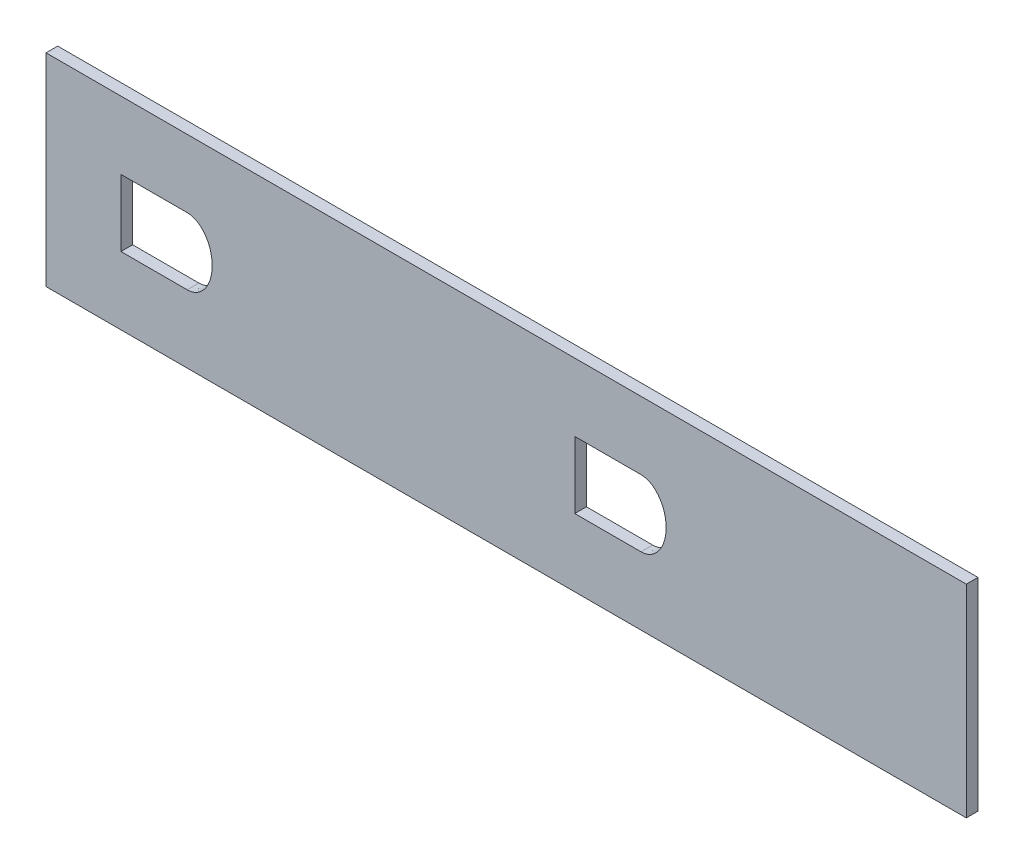
ISO-10303-21;
HEADER;
FILE_DESCRIPTION(('STEP AP214'),'2;1');
FILE_NAME('part.step','',(''),(''),'','','');
FILE_SCHEMA(('AUTOMOTIVE_DESIGN { 1 0 10303 214 1 1 1 1 }'));
ENDSEC;
DATA;
#1=APPLICATION_CONTEXT('core data for automotive mechanical design processes');
#2=APPLICATION_PROTOCOL_DEFINITION('international standard','automotive_design',2000,#1);
#3=PRODUCT_CONTEXT('',#1,'mechanical');
#4=PRODUCT('Part','Part','',(#3));
#5=PRODUCT_RELATED_PRODUCT_CATEGORY('part','',(#4));
#6=PRODUCT_DEFINITION_FORMATION('','',#4);
#7=PRODUCT_DEFINITION_CONTEXT('part definition',#1,'design');
#8=PRODUCT_DEFINITION('design','',#6,#7);
#9=PRODUCT_DEFINITION_SHAPE('','',#8);
#10=(LENGTH_UNIT() NAMED_UNIT(*) SI_UNIT(.MILLI.,.METRE.));
#11=(NAMED_UNIT(*) PLANE_ANGLE_UNIT() SI_UNIT($,.RADIAN.));
#12=(NAMED_UNIT(*) SI_UNIT($,.STERADIAN.) SOLID_ANGLE_UNIT());
#13=UNCERTAINTY_MEASURE_WITH_UNIT(LENGTH_MEASURE(1.E-05),#10,'distance_accuracy_value','');
#14=(GEOMETRIC_REPRESENTATION_CONTEXT(3) GLOBAL_UNCERTAINTY_ASSIGNED_CONTEXT((#13)) GLOBAL_UNIT_ASSIGNED_CONTEXT((#10,
#11,#12)) REPRESENTATION_CONTEXT('',''));
#15=CARTESIAN_POINT('',(0.,0.,0.));
#16=DIRECTION('',(0.,0.,1.));
#17=DIRECTION('',(1.,0.,0.));
#18=AXIS2_PLACEMENT_3D('',#15,#16,#17);
#19=CARTESIAN_POINT('',(0.,0.,3.175));
#20=DIRECTION('',(0.,0.,-1.));
#21=DIRECTION('',(-1.,0.,0.));
#22=AXIS2_PLACEMENT_3D('',#19,#20,#21);
#23=PLANE('',#22);
#24=CARTESIAN_POINT('',(154.922131775069,92.5118305241373,3.175));
#25=CARTESIAN_POINT('',(155.451072122834,92.50958186259,3.175));
#26=CARTESIAN_POINT('',(155.966488743538,92.5872283059475,3.175));
#27=CARTESIAN_POINT('',(156.720262524495,92.8180201663427,3.175));
#28=CARTESIAN_POINT('',(156.967329601161,92.9142100461991,3.175));
#29=CARTESIAN_POINT('',(157.440562635818,93.1370676149043,3.175));
#30=CARTESIAN_POINT('',(157.66870997454,93.2642896837003,3.175));
#31=CARTESIAN_POINT('',(158.109361081418,93.547905878124,3.175));
#32=CARTESIAN_POINT('',(158.322848526987,93.7052953379579,3.175));
#33=CARTESIAN_POINT('',(158.725811926167,94.0398776946519,3.175));
#34=CARTESIAN_POINT('',(158.916365170045,94.2175735112476,3.175));
#35=CARTESIAN_POINT('',(159.277979375497,94.5915231320785,3.175));
#36=CARTESIAN_POINT('',(159.449028618166,94.7877880935133,3.175));
#37=CARTESIAN_POINT('',(159.773040585186,95.197537620439,3.175));
#38=CARTESIAN_POINT('',(159.926674600091,95.4121290585207,3.175));
#39=CARTESIAN_POINT('',(160.355672211454,96.0712690522382,3.175));
#40=CARTESIAN_POINT('',(160.599679107189,96.5301270838029,3.175));
#41=CARTESIAN_POINT('',(161.016221353168,97.4809162590623,3.175));
#42=CARTESIAN_POINT('',(161.188951810193,97.9742694025772,3.175));
#43=CARTESIAN_POINT('',(161.602577215803,99.4931220115654,3.175));
#44=CARTESIAN_POINT('',(161.73359264352,100.524931205306,3.175));
#45=CARTESIAN_POINT('',(161.735557124766,102.623122345367,3.175));
#46=CARTESIAN_POINT('',(161.605853875756,103.653679040349,3.175));
#47=CARTESIAN_POINT('',(161.200790672101,105.159416326973,3.175));
#48=CARTESIAN_POINT('',(161.028182443224,105.658994330539,3.175));
#49=CARTESIAN_POINT('',(160.612184007481,106.616383576777,3.175));
#50=CARTESIAN_POINT('',(160.369184420594,107.075786107166,3.175));
#51=CARTESIAN_POINT('',(159.803943698579,107.950913477118,3.175));
#52=CARTESIAN_POINT('',(159.477972125658,108.370019433913,3.175));
#53=CARTESIAN_POINT('',(158.755362197718,109.122883671395,3.175));
#54=CARTESIAN_POINT('',(158.35777701687,109.460222149506,3.175));
#55=CARTESIAN_POINT('',(157.472283398277,110.036389619616,3.175));
#56=CARTESIAN_POINT('',(157.002434247253,110.263188922867,3.175));
#57=CARTESIAN_POINT('',(156.251245807354,110.498433871764,3.175));
#58=CARTESIAN_POINT('',(155.992182160484,110.558924387464,3.175));
#59=CARTESIAN_POINT('',(155.47582364748,110.638710893681,3.175));
#60=CARTESIAN_POINT('',(155.216383747324,110.658836285765,3.175));
#61=CARTESIAN_POINT('',(154.695009918083,110.659978780235,3.175));
#62=CARTESIAN_POINT('',(154.431095247901,110.640701574291,3.175));
#63=CARTESIAN_POINT('',(153.910289290079,110.562114075801,3.175));
#64=CARTESIAN_POINT('',(153.655525940508,110.503481148267,3.175));
#65=CARTESIAN_POINT('',(152.9071232249,110.273102195265,3.175));
#66=CARTESIAN_POINT('',(152.425108618962,110.043206699969,3.175));
#67=CARTESIAN_POINT('',(151.765189327718,109.618881991929,3.175));
#68=CARTESIAN_POINT('',(151.554283650929,109.463896805024,3.175));
#69=CARTESIAN_POINT('',(151.149237669747,109.128884712107,3.175));
#70=CARTESIAN_POINT('',(150.955383152028,108.948824722019,3.175));
#71=CARTESIAN_POINT('',(150.409337016022,108.386227365254,3.175));
#72=CARTESIAN_POINT('',(150.087348777121,107.977727043503,3.175));
#73=CARTESIAN_POINT('',(149.657727519858,107.322539743442,3.175));
#74=CARTESIAN_POINT('',(149.523002902212,107.095990511624,3.175));
#75=CARTESIAN_POINT('',(149.273641031869,106.634191326719,3.175));
#76=CARTESIAN_POINT('',(149.159230404404,106.399606928325,3.175));
#77=CARTESIAN_POINT('',(148.844302450094,105.685698781086,3.175));
#78=CARTESIAN_POINT('',(148.671877117622,105.196296118275,3.175));
#79=CARTESIAN_POINT('',(148.395778993735,104.192823589,3.175));
#80=CARTESIAN_POINT('',(148.291945980141,103.675154874473,3.175));
#81=CARTESIAN_POINT('',(148.155434551003,102.639811275944,3.175));
#82=CARTESIAN_POINT('',(148.121907539099,102.120882193076,3.175));
#83=CARTESIAN_POINT('',(148.120620469946,101.080643065558,3.175));
#84=CARTESIAN_POINT('',(148.153178729199,100.55679449383,3.175));
#85=CARTESIAN_POINT('',(148.28798979255,99.5180305681715,3.175));
#86=CARTESIAN_POINT('',(148.389132933896,99.0087462753487,3.175));
#87=CARTESIAN_POINT('',(148.660372295199,98.0108153531445,3.175));
#88=CARTESIAN_POINT('',(148.830374423647,97.5221405621647,3.175));
#89=CARTESIAN_POINT('',(149.247047531098,96.5677379749753,3.175));
#90=CARTESIAN_POINT('',(149.496015441349,96.0994340722305,3.175));
#91=CARTESIAN_POINT('',(150.064325141074,95.2246507105133,3.175));
#92=CARTESIAN_POINT('',(150.384695811896,94.8139947344025,3.175));
#93=CARTESIAN_POINT('',(150.930587216426,94.2462435003589,3.175));
#94=CARTESIAN_POINT('',(151.123829439118,94.0651597608847,3.175));
#95=CARTESIAN_POINT('',(151.525384514642,93.7295626045616,3.175));
#96=CARTESIAN_POINT('',(151.734697278583,93.5739125001113,3.175));
#97=CARTESIAN_POINT('',(152.390499243646,93.1466214874872,3.175));
#98=CARTESIAN_POINT('',(152.871681916921,92.9130003297597,3.175));
#99=CARTESIAN_POINT('',(153.61862310046,92.6772812203988,3.175));
#100=CARTESIAN_POINT('',(153.872798462709,92.616861833556,3.175));
#101=CARTESIAN_POINT('',(154.392171087141,92.5345387388178,3.175));
#102=CARTESIAN_POINT('',(154.657661601187,92.5129548549109,3.175));
#103=CARTESIAN_POINT('',(154.922131775069,92.5118305241373,3.175));
#104=B_SPLINE_CURVE_WITH_KNOTS('',3,(#24,#25,#26,#27,#28,#29,#30,#31,#32,#33,#34,#35,#36,#37,
#38,#39,#40,#41,#42,#43,#44,#45,#46,#47,#48,#49,#50,#51,#52,#53,#54,#55,#56,#57,#58,#59,#60,#61,
#62,#63,#64,#65,#66,#67,#68,#69,#70,#71,#72,#73,#74,#75,#76,#77,#78,#79,#80,#81,#82,#83,#84,#85,
#86,#87,#88,#89,#90,#91,#92,#93,#94,#95,#96,#97,#98,#99,#100,#101,#102,#103),.UNSPECIFIED.,.T.,
.F.,(4,2,2,2,2,2,2,2,2,2,2,2,2,2,2,2,2,2,2,2,2,2,2,2,2,2,2,2,2,2,2,2,2,2,2,2,2,2,2,4),(0.,
0.0312500000000002,0.0468750000000012,0.0625000000000022,0.0781250000000031,0.0937500000000041,
0.109375000000005,0.125000000000006,0.156250000000008,0.187500000000011,0.250000000000015,
0.312500000000019,0.34375000000002,0.375000000000021,0.406250000000022,0.437500000000023,
0.468750000000025,0.484375000000024,0.500000000000024,0.515625000000023,0.531250000000023,
0.562500000000022,0.578125000000022,0.593750000000021,0.625000000000022,0.640625000000022,
0.656250000000022,0.68750000000002,0.718750000000019,0.750000000000017,0.781250000000015,
0.812500000000013,0.843750000000012,0.87500000000001,0.906250000000008,0.921875000000007,
0.937500000000007,0.968750000000004,0.984375000000002,1.),.UNSPECIFIED.);
#105=CARTESIAN_POINT('',(154.944461655891,92.5117830471494,3.175));
#106=VERTEX_POINT('',#105);
#107=CARTESIAN_POINT('',(154.944441506955,110.65941986306,3.175));
#108=VERTEX_POINT('',#107);
#109=EDGE_CURVE('E184',#106,#108,#104,.T.);
#110=ORIENTED_EDGE('',*,*,#109,.F.);
#111=DIRECTION('',(1.,0.,0.));
#112=VECTOR('',#111,1.);
#113=CARTESIAN_POINT('',(136.944461655891,92.5117830471494,3.175));
#114=LINE('',#113,#112);
#115=CARTESIAN_POINT('',(136.944461655891,92.5117830471494,3.175));
#116=VERTEX_POINT('',#115);
#117=EDGE_CURVE('E199',#116,#106,#114,.T.);
#118=ORIENTED_EDGE('',*,*,#117,.F.);
#119=DIRECTION('',(0.,-1.,0.));
#120=VECTOR('',#119,1.);
#121=CARTESIAN_POINT('',(136.944461655891,110.659419863063,3.175));
#122=LINE('',#121,#120);
#123=CARTESIAN_POINT('',(136.944461655891,110.659419863063,3.175));
#124=VERTEX_POINT('',#123);
#125=EDGE_CURVE('E196',#124,#116,#122,.T.);
#126=ORIENTED_EDGE('',*,*,#125,.F.);
#127=DIRECTION('',(-1.,1.67304629183672E-13,0.));
#128=VECTOR('',#127,1.);
#129=CARTESIAN_POINT('',(154.944441506955,110.65941986306,3.175));
#130=LINE('',#129,#128);
#131=EDGE_CURVE('E189',#108,#124,#130,.T.);
#132=ORIENTED_EDGE('',*,*,#131,.F.);
#133=EDGE_LOOP('',(#110,#118,#126,#132));
#134=FACE_BOUND('',#133,.T.);
#135=DIRECTION('',(0.,1.,0.));
#136=VECTOR('',#135,1.);
#137=CARTESIAN_POINT('',(366.588298269734,74.0830697008945,3.175));
#138=LINE('',#137,#136);
#139=CARTESIAN_POINT('',(366.588298269734,74.0830697008945,3.175));
#140=VERTEX_POINT('',#139);
#141=CARTESIAN_POINT('',(366.588298269734,129.083069700894,3.175));
#142=VERTEX_POINT('',#141);
#143=EDGE_CURVE('E227',#140,#142,#138,.T.);
#144=ORIENTED_EDGE('',*,*,#143,.T.);
#145=DIRECTION('',(-1.,0.,0.));
#146=VECTOR('',#145,1.);
#147=CARTESIAN_POINT('',(116.588298269734,129.083069700894,3.175));
#148=LINE('',#147,#146);
#149=CARTESIAN_POINT('',(116.588298269734,129.083069700894,3.175));
#150=VERTEX_POINT('',#149);
#151=EDGE_CURVE('E230',#142,#150,#148,.T.);
#152=ORIENTED_EDGE('',*,*,#151,.T.);
#153=DIRECTION('',(0.,-1.,0.));
#154=VECTOR('',#153,1.);
#155=CARTESIAN_POINT('',(116.588298269734,74.0830697008944,3.175));
#156=LINE('',#155,#154);
#157=CARTESIAN_POINT('',(116.588298269734,74.0830697008944,3.175));
#158=VERTEX_POINT('',#157);
#159=EDGE_CURVE('E233',#150,#158,#156,.T.);
#160=ORIENTED_EDGE('',*,*,#159,.T.);
#161=DIRECTION('',(1.,0.,0.));
#162=VECTOR('',#161,1.);
#163=CARTESIAN_POINT('',(116.588298269734,74.0830697008944,3.175));
#164=LINE('',#163,#162);
#165=EDGE_CURVE('E235',#158,#140,#164,.T.);
#166=ORIENTED_EDGE('',*,*,#165,.T.);
#167=EDGE_LOOP('',(#144,#152,#160,#166));
#168=FACE_BOUND('',#167,.T.);
#169=DIRECTION('',(1.,0.,0.));
#170=VECTOR('',#169,1.);
#171=CARTESIAN_POINT('',(260.222355303343,92.511784215595,3.175));
#172=LINE('',#171,#170);
#173=CARTESIAN_POINT('',(260.222355303343,92.511784215595,3.175));
#174=VERTEX_POINT('',#173);
#175=CARTESIAN_POINT('',(278.222671977076,92.511784215592,3.175));
#176=VERTEX_POINT('',#175);
#177=EDGE_CURVE('E126',#174,#176,#172,.T.);
#178=ORIENTED_EDGE('',*,*,#177,.F.);
#179=DIRECTION('',(0.,-1.,0.));
#180=VECTOR('',#179,1.);
#181=CARTESIAN_POINT('',(260.222355303343,110.65941998397,3.175));
#182=LINE('',#181,#180);
#183=CARTESIAN_POINT('',(260.222355303343,110.65941998397,3.175));
#184=VERTEX_POINT('',#183);
#185=EDGE_CURVE('E148',#184,#174,#182,.T.);
#186=ORIENTED_EDGE('',*,*,#185,.F.);
#187=DIRECTION('',(-1.,0.,0.));
#188=VECTOR('',#187,1.);
#189=CARTESIAN_POINT('',(278.222355303343,110.65941998397,3.175));
#190=LINE('',#189,#188);
#191=CARTESIAN_POINT('',(278.222355303343,110.65941998397,3.175));
#192=VERTEX_POINT('',#191);
#193=EDGE_CURVE('E146',#192,#184,#190,.T.);
#194=ORIENTED_EDGE('',*,*,#193,.F.);
#195=CARTESIAN_POINT('',(278.244464764398,92.5118305241373,3.175));
#196=CARTESIAN_POINT('',(278.773421896324,92.5140792570382,3.175));
#197=CARTESIAN_POINT('',(279.288142611514,92.596096823464,3.175));
#198=CARTESIAN_POINT('',(280.040047698589,92.8321723254875,3.175));
#199=CARTESIAN_POINT('',(280.286553449094,92.9299719128162,3.175));
#200=CARTESIAN_POINT('',(280.758602429583,93.1555626458557,3.175));
#201=CARTESIAN_POINT('',(280.986126811532,93.2839180024771,3.175));
#202=CARTESIAN_POINT('',(281.425506636801,93.5693117067424,3.175));
#203=CARTESIAN_POINT('',(281.638411531725,93.7273826234056,3.175));
#204=CARTESIAN_POINT('',(282.040609192108,94.063197755952,3.175));
#205=CARTESIAN_POINT('',(282.230823379992,94.2413326460542,3.175));
#206=CARTESIAN_POINT('',(282.591831942944,94.6158494856255,3.175));
#207=CARTESIAN_POINT('',(282.76261460547,94.8122424403208,3.175));
#208=CARTESIAN_POINT('',(283.08615194898,95.2219676298465,3.175));
#209=CARTESIAN_POINT('',(283.239528042897,95.4363045123148,3.175));
#210=CARTESIAN_POINT('',(283.668884518686,96.0960804672866,3.175));
#211=CARTESIAN_POINT('',(283.913097500502,96.5550380529654,3.175));
#212=CARTESIAN_POINT('',(284.329853528498,97.5055386996938,3.175));
#213=CARTESIAN_POINT('',(284.502330929515,97.997517384757,3.175));
#214=CARTESIAN_POINT('',(284.91642511353,99.517971016755,3.175));
#215=CARTESIAN_POINT('',(285.046378019531,100.549745306848,3.175));
#216=CARTESIAN_POINT('',(285.044814781937,102.121799944166,3.175));
#217=CARTESIAN_POINT('',(285.010624566593,102.644051201392,3.175));
#218=CARTESIAN_POINT('',(284.875060839701,103.67187907438,3.175));
#219=CARTESIAN_POINT('',(284.77375636693,104.179515710883,3.175));
#220=CARTESIAN_POINT('',(284.568084190159,104.930912137642,3.175));
#221=CARTESIAN_POINT('',(284.490533244968,105.179693519094,3.175));
#222=CARTESIAN_POINT('',(284.316216827901,105.673658252171,3.175));
#223=CARTESIAN_POINT('',(284.219380858918,105.918716084619,3.175));
#224=CARTESIAN_POINT('',(283.903445519512,106.635729238192,3.175));
#225=CARTESIAN_POINT('',(283.657868711848,107.093856455726,3.175));
#226=CARTESIAN_POINT('',(283.088219022091,107.96546200023,3.175));
#227=CARTESIAN_POINT('',(282.760173435189,108.382711444906,3.175));
#228=CARTESIAN_POINT('',(282.033463395118,109.13247113604,3.175));
#229=CARTESIAN_POINT('',(281.634553417858,109.467765519068,3.175));
#230=CARTESIAN_POINT('',(280.748361649332,110.039964653802,3.175));
#231=CARTESIAN_POINT('',(280.276240556554,110.266288644905,3.175));
#232=CARTESIAN_POINT('',(279.5256055812,110.499795693153,3.175));
#233=CARTESIAN_POINT('',(279.266245360834,110.559993759381,3.175));
#234=CARTESIAN_POINT('',(278.74913197916,110.639237798879,3.175));
#235=CARTESIAN_POINT('',(278.489592578708,110.659075845263,3.175));
#236=CARTESIAN_POINT('',(277.968576738938,110.659755346663,3.175));
#237=CARTESIAN_POINT('',(277.705739424316,110.64036722656,3.175));
#238=CARTESIAN_POINT('',(277.184023608902,110.561035237292,3.175));
#239=CARTESIAN_POINT('',(276.929142893503,110.501933243247,3.175));
#240=CARTESIAN_POINT('',(276.18126552645,110.270113332047,3.175));
#241=CARTESIAN_POINT('',(275.700015579309,110.038969122054,3.175));
#242=CARTESIAN_POINT('',(275.041406475089,109.612107912205,3.175));
#243=CARTESIAN_POINT('',(274.831199129765,109.456312410273,3.175));
#244=CARTESIAN_POINT('',(274.427957501716,109.119854798806,3.175));
#245=CARTESIAN_POINT('',(274.234681563174,108.938684274543,3.175));
#246=CARTESIAN_POINT('',(273.69087265876,108.372863912495,3.175));
#247=CARTESIAN_POINT('',(273.371132047598,107.962581247229,3.175));
#248=CARTESIAN_POINT('',(272.803442127643,107.086545180786,3.175));
#249=CARTESIAN_POINT('',(272.555460171743,106.618328462242,3.175));
#250=CARTESIAN_POINT('',(272.140246084283,105.663673469707,3.175));
#251=CARTESIAN_POINT('',(271.970280108895,105.173422247842,3.175));
#252=CARTESIAN_POINT('',(271.698796298654,104.169418744634,3.175));
#253=CARTESIAN_POINT('',(271.597044089733,103.652000397504,3.175));
#254=CARTESIAN_POINT('',(271.463750137216,102.61520325544,3.175));
#255=CARTESIAN_POINT('',(271.431619183692,102.096013456944,3.175));
#256=CARTESIAN_POINT('',(271.432420625684,101.056142381365,3.175));
#257=CARTESIAN_POINT('',(271.465480168026,100.534518706538,3.175));
#258=CARTESIAN_POINT('',(271.60143378631,99.4935606239007,3.175));
#259=CARTESIAN_POINT('',(271.702953336501,98.9837109978605,3.175));
#260=CARTESIAN_POINT('',(271.974334699447,97.9856688395986,3.175));
#261=CARTESIAN_POINT('',(272.144107774676,97.497448187194,3.175));
#262=CARTESIAN_POINT('',(272.559447021439,96.5450250833622,3.175));
#263=CARTESIAN_POINT('',(272.807968522787,96.0766640973058,3.175));
#264=CARTESIAN_POINT('',(273.377301291151,95.2002096366313,3.175));
#265=CARTESIAN_POINT('',(273.698044062811,94.7896915472667,3.175));
#266=CARTESIAN_POINT('',(274.24387214837,94.2236191503369,3.175));
#267=CARTESIAN_POINT('',(274.437733921714,94.0426028701799,3.175));
#268=CARTESIAN_POINT('',(274.840910970945,93.7074615598039,3.175));
#269=CARTESIAN_POINT('',(275.050943128877,93.552404952883,3.175));
#270=CARTESIAN_POINT('',(275.489290372446,93.2693883017634,3.175));
#271=CARTESIAN_POINT('',(275.717594252101,93.1414116495259,3.175));
#272=CARTESIAN_POINT('',(276.19478358475,92.9159616595021,3.175));
#273=CARTESIAN_POINT('',(276.440761069653,92.8201125779056,3.175));
#274=CARTESIAN_POINT('',(276.940166093122,92.6664425289211,3.175));
#275=CARTESIAN_POINT('',(277.194749166095,92.6080570743242,3.175));
#276=CARTESIAN_POINT('',(277.714173451766,92.5300641368901,3.175));
#277=CARTESIAN_POINT('',(277.979986198434,92.5107061576868,3.175));
#278=CARTESIAN_POINT('',(278.244464764398,92.5118305241373,3.175));
#279=B_SPLINE_CURVE_WITH_KNOTS('',3,(#195,#196,#197,#198,#199,#200,#201,#202,#203,#204,#205,
#206,#207,#208,#209,#210,#211,#212,#213,#214,#215,#216,#217,#218,#219,#220,#221,#222,#223,#224,
#225,#226,#227,#228,#229,#230,#231,#232,#233,#234,#235,#236,#237,#238,#239,#240,#241,#242,#243,
#244,#245,#246,#247,#248,#249,#250,#251,#252,#253,#254,#255,#256,#257,#258,#259,#260,#261,#262,
#263,#264,#265,#266,#267,#268,#269,#270,#271,#272,#273,#274,#275,#276,#277,#278),.UNSPECIFIED.,
.T.,.F.,(4,2,2,2,2,2,2,2,2,2,2,2,2,2,2,2,2,2,2,2,2,2,2,2,2,2,2,2,2,2,2,2,2,2,2,2,2,2,2,2,2,4),
(0.,0.0312500000000012,0.0468750000000019,0.0625000000000025,0.0781250000000031,
0.0937500000000037,0.109375000000004,0.125000000000005,0.156250000000005,0.187500000000006,
0.250000000000006,0.281250000000007,0.312500000000008,0.328125000000007,0.343750000000007,
0.375000000000004,0.406250000000001,0.437499999999997,0.468749999999994,0.484374999999993,
0.499999999999991,0.515624999999989,0.531249999999988,0.562499999999984,0.578124999999984,
0.593749999999984,0.624999999999986,0.656249999999987,0.687499999999989,0.718749999999991,
0.749999999999992,0.781249999999994,0.812499999999996,0.843749999999998,0.874999999999999,
0.906250000000001,0.921875000000001,0.937500000000001,0.953125,0.96875,0.984375,1.),.UNSPECIFIED.);
#280=EDGE_CURVE('E134',#176,#192,#279,.T.);
#281=ORIENTED_EDGE('',*,*,#280,.F.);
#282=EDGE_LOOP('',(#178,#186,#194,#281));
#283=FACE_BOUND('',#282,.T.);
#284=ADVANCED_FACE('F37',(#134,#168,#283),#23,.F.);
#285=CARTESIAN_POINT('',(0.,0.,0.));
#286=DIRECTION('',(0.,0.,-1.));
#287=DIRECTION('',(-1.,0.,0.));
#288=AXIS2_PLACEMENT_3D('',#285,#286,#287);
#289=PLANE('',#288);
#290=DIRECTION('',(0.,1.,0.));
#291=VECTOR('',#290,1.);
#292=CARTESIAN_POINT('',(366.588298269734,74.0830697008945,0.));
#293=LINE('',#292,#291);
#294=CARTESIAN_POINT('',(366.588298269734,74.0830697008945,0.));
#295=VERTEX_POINT('',#294);
#296=CARTESIAN_POINT('',(366.588298269734,129.083069700894,0.));
#297=VERTEX_POINT('',#296);
#298=EDGE_CURVE('E226',#295,#297,#293,.T.);
#299=ORIENTED_EDGE('',*,*,#298,.F.);
#300=DIRECTION('',(1.,0.,0.));
#301=VECTOR('',#300,1.);
#302=CARTESIAN_POINT('',(116.588298269734,74.0830697008944,0.));
#303=LINE('',#302,#301);
#304=CARTESIAN_POINT('',(116.588298269734,74.0830697008944,0.));
#305=VERTEX_POINT('',#304);
#306=EDGE_CURVE('E231',#305,#295,#303,.T.);
#307=ORIENTED_EDGE('',*,*,#306,.F.);
#308=DIRECTION('',(0.,-1.,0.));
#309=VECTOR('',#308,1.);
#310=CARTESIAN_POINT('',(116.588298269734,74.0830697008944,0.));
#311=LINE('',#310,#309);
#312=CARTESIAN_POINT('',(116.588298269734,129.083069700894,0.));
#313=VERTEX_POINT('',#312);
#314=EDGE_CURVE('E242',#313,#305,#311,.T.);
#315=ORIENTED_EDGE('',*,*,#314,.F.);
#316=DIRECTION('',(-1.,0.,0.));
#317=VECTOR('',#316,1.);
#318=CARTESIAN_POINT('',(116.588298269734,129.083069700894,0.));
#319=LINE('',#318,#317);
#320=EDGE_CURVE('E240',#297,#313,#319,.T.);
#321=ORIENTED_EDGE('',*,*,#320,.F.);
#322=EDGE_LOOP('',(#299,#307,#315,#321));
#323=FACE_BOUND('',#322,.T.);
#324=DIRECTION('',(1.,0.,0.));
#325=VECTOR('',#324,1.);
#326=CARTESIAN_POINT('',(136.944461655891,92.5117830471494,0.));
#327=LINE('',#326,#325);
#328=CARTESIAN_POINT('',(136.944461655891,92.5117830471494,0.));
#329=VERTEX_POINT('',#328);
#330=CARTESIAN_POINT('',(154.944461655891,92.5117830471494,0.));
#331=VERTEX_POINT('',#330);
#332=EDGE_CURVE('E190',#329,#331,#327,.T.);
#333=ORIENTED_EDGE('',*,*,#332,.T.);
#334=CARTESIAN_POINT('',(154.922131775069,92.5118305241373,0.));
#335=CARTESIAN_POINT('',(155.451072122834,92.50958186259,0.));
#336=CARTESIAN_POINT('',(155.966488743538,92.5872283059475,0.));
#337=CARTESIAN_POINT('',(156.720262524495,92.8180201663427,0.));
#338=CARTESIAN_POINT('',(156.967329601161,92.9142100461991,0.));
#339=CARTESIAN_POINT('',(157.440562635818,93.1370676149043,0.));
#340=CARTESIAN_POINT('',(157.66870997454,93.2642896837003,0.));
#341=CARTESIAN_POINT('',(158.109361081418,93.547905878124,0.));
#342=CARTESIAN_POINT('',(158.322848526987,93.7052953379579,0.));
#343=CARTESIAN_POINT('',(158.725811926167,94.0398776946519,0.));
#344=CARTESIAN_POINT('',(158.916365170045,94.2175735112476,0.));
#345=CARTESIAN_POINT('',(159.277979375497,94.5915231320785,0.));
#346=CARTESIAN_POINT('',(159.449028618166,94.7877880935133,0.));
#347=CARTESIAN_POINT('',(159.773040585186,95.197537620439,0.));
#348=CARTESIAN_POINT('',(159.926674600091,95.4121290585207,0.));
#349=CARTESIAN_POINT('',(160.355672211454,96.0712690522382,0.));
#350=CARTESIAN_POINT('',(160.599679107189,96.5301270838029,0.));
#351=CARTESIAN_POINT('',(161.016221353168,97.4809162590623,0.));
#352=CARTESIAN_POINT('',(161.188951810193,97.9742694025772,0.));
#353=CARTESIAN_POINT('',(161.602577215803,99.4931220115654,0.));
#354=CARTESIAN_POINT('',(161.73359264352,100.524931205306,0.));
#355=CARTESIAN_POINT('',(161.735557124766,102.623122345367,0.));
#356=CARTESIAN_POINT('',(161.605853875756,103.653679040349,0.));
#357=CARTESIAN_POINT('',(161.200790672101,105.159416326973,0.));
#358=CARTESIAN_POINT('',(161.028182443224,105.658994330539,0.));
#359=CARTESIAN_POINT('',(160.612184007481,106.616383576777,0.));
#360=CARTESIAN_POINT('',(160.369184420594,107.075786107166,0.));
#361=CARTESIAN_POINT('',(159.803943698579,107.950913477118,0.));
#362=CARTESIAN_POINT('',(159.477972125658,108.370019433913,0.));
#363=CARTESIAN_POINT('',(158.755362197718,109.122883671395,0.));
#364=CARTESIAN_POINT('',(158.35777701687,109.460222149506,0.));
#365=CARTESIAN_POINT('',(157.472283398277,110.036389619616,0.));
#366=CARTESIAN_POINT('',(157.002434247253,110.263188922867,0.));
#367=CARTESIAN_POINT('',(156.251245807354,110.498433871764,0.));
#368=CARTESIAN_POINT('',(155.992182160484,110.558924387464,0.));
#369=CARTESIAN_POINT('',(155.47582364748,110.638710893681,0.));
#370=CARTESIAN_POINT('',(155.216383747324,110.658836285765,0.));
#371=CARTESIAN_POINT('',(154.695009918083,110.659978780235,0.));
#372=CARTESIAN_POINT('',(154.431095247901,110.640701574291,0.));
#373=CARTESIAN_POINT('',(153.910289290079,110.562114075801,0.));
#374=CARTESIAN_POINT('',(153.655525940508,110.503481148267,0.));
#375=CARTESIAN_POINT('',(152.9071232249,110.273102195265,0.));
#376=CARTESIAN_POINT('',(152.425108618962,110.043206699969,0.));
#377=CARTESIAN_POINT('',(151.765189327718,109.618881991929,0.));
#378=CARTESIAN_POINT('',(151.554283650929,109.463896805024,0.));
#379=CARTESIAN_POINT('',(151.149237669747,109.128884712107,0.));
#380=CARTESIAN_POINT('',(150.955383152028,108.948824722019,0.));
#381=CARTESIAN_POINT('',(150.409337016022,108.386227365254,0.));
#382=CARTESIAN_POINT('',(150.087348777121,107.977727043503,0.));
#383=CARTESIAN_POINT('',(149.657727519858,107.322539743442,0.));
#384=CARTESIAN_POINT('',(149.523002902212,107.095990511624,0.));
#385=CARTESIAN_POINT('',(149.273641031869,106.634191326719,0.));
#386=CARTESIAN_POINT('',(149.159230404404,106.399606928325,0.));
#387=CARTESIAN_POINT('',(148.844302450094,105.685698781086,0.));
#388=CARTESIAN_POINT('',(148.671877117622,105.196296118275,0.));
#389=CARTESIAN_POINT('',(148.395778993735,104.192823589,0.));
#390=CARTESIAN_POINT('',(148.291945980141,103.675154874473,0.));
#391=CARTESIAN_POINT('',(148.155434551003,102.639811275944,0.));
#392=CARTESIAN_POINT('',(148.121907539099,102.120882193076,0.));
#393=CARTESIAN_POINT('',(148.120620469946,101.080643065558,0.));
#394=CARTESIAN_POINT('',(148.153178729199,100.55679449383,0.));
#395=CARTESIAN_POINT('',(148.28798979255,99.5180305681715,0.));
#396=CARTESIAN_POINT('',(148.389132933896,99.0087462753487,0.));
#397=CARTESIAN_POINT('',(148.660372295199,98.0108153531445,0.));
#398=CARTESIAN_POINT('',(148.830374423647,97.5221405621647,0.));
#399=CARTESIAN_POINT('',(149.247047531098,96.5677379749753,0.));
#400=CARTESIAN_POINT('',(149.496015441349,96.0994340722305,0.));
#401=CARTESIAN_POINT('',(150.064325141074,95.2246507105133,0.));
#402=CARTESIAN_POINT('',(150.384695811896,94.8139947344025,0.));
#403=CARTESIAN_POINT('',(150.930587216426,94.2462435003589,0.));
#404=CARTESIAN_POINT('',(151.123829439118,94.0651597608847,0.));
#405=CARTESIAN_POINT('',(151.525384514642,93.7295626045616,0.));
#406=CARTESIAN_POINT('',(151.734697278583,93.5739125001113,0.));
#407=CARTESIAN_POINT('',(152.390499243646,93.1466214874872,0.));
#408=CARTESIAN_POINT('',(152.871681916921,92.9130003297597,0.));
#409=CARTESIAN_POINT('',(153.61862310046,92.6772812203988,0.));
#410=CARTESIAN_POINT('',(153.872798462709,92.616861833556,0.));
#411=CARTESIAN_POINT('',(154.392171087141,92.5345387388178,0.));
#412=CARTESIAN_POINT('',(154.657661601187,92.5129548549109,0.));
#413=CARTESIAN_POINT('',(154.922131775069,92.5118305241373,0.));
#414=B_SPLINE_CURVE_WITH_KNOTS('',3,(#334,#335,#336,#337,#338,#339,#340,#341,#342,#343,#344,
#345,#346,#347,#348,#349,#350,#351,#352,#353,#354,#355,#356,#357,#358,#359,#360,#361,#362,#363,
#364,#365,#366,#367,#368,#369,#370,#371,#372,#373,#374,#375,#376,#377,#378,#379,#380,#381,#382,
#383,#384,#385,#386,#387,#388,#389,#390,#391,#392,#393,#394,#395,#396,#397,#398,#399,#400,#401,
#402,#403,#404,#405,#406,#407,#408,#409,#410,#411,#412,#413),.UNSPECIFIED.,.T.,.F.,(4,2,2,2,2,2,
2,2,2,2,2,2,2,2,2,2,2,2,2,2,2,2,2,2,2,2,2,2,2,2,2,2,2,2,2,2,2,2,2,4),(0.,0.0312500000000002,
0.0468750000000012,0.0625000000000022,0.0781250000000031,0.0937500000000041,0.109375000000005,
0.125000000000006,0.156250000000008,0.187500000000011,0.250000000000015,0.312500000000019,
0.34375000000002,0.375000000000021,0.406250000000022,0.437500000000023,0.468750000000025,
0.484375000000024,0.500000000000024,0.515625000000023,0.531250000000023,0.562500000000022,
0.578125000000022,0.593750000000021,0.625000000000022,0.640625000000022,0.656250000000022,
0.68750000000002,0.718750000000019,0.750000000000017,0.781250000000015,0.812500000000013,
0.843750000000012,0.87500000000001,0.906250000000008,0.921875000000007,0.937500000000007,
0.968750000000004,0.984375000000002,1.),.UNSPECIFIED.);
#415=CARTESIAN_POINT('',(154.944441506955,110.65941986306,0.));
#416=VERTEX_POINT('',#415);
#417=EDGE_CURVE('E142',#331,#416,#414,.T.);
#418=ORIENTED_EDGE('',*,*,#417,.T.);
#419=DIRECTION('',(-1.,1.67304629183672E-13,0.));
#420=VECTOR('',#419,1.);
#421=CARTESIAN_POINT('',(154.944441506955,110.65941986306,0.));
#422=LINE('',#421,#420);
#423=CARTESIAN_POINT('',(136.944461655891,110.659419863063,0.));
#424=VERTEX_POINT('',#423);
#425=EDGE_CURVE('E206',#416,#424,#422,.T.);
#426=ORIENTED_EDGE('',*,*,#425,.T.);
#427=DIRECTION('',(0.,-1.,0.));
#428=VECTOR('',#427,1.);
#429=CARTESIAN_POINT('',(136.944461655891,110.659419863063,0.));
#430=LINE('',#429,#428);
#431=EDGE_CURVE('E212',#424,#329,#430,.T.);
#432=ORIENTED_EDGE('',*,*,#431,.T.);
#433=EDGE_LOOP('',(#333,#418,#426,#432));
#434=FACE_BOUND('',#433,.T.);
#435=DIRECTION('',(0.,-1.,0.));
#436=VECTOR('',#435,1.);
#437=CARTESIAN_POINT('',(260.222355303343,110.65941998397,0.));
#438=LINE('',#437,#436);
#439=CARTESIAN_POINT('',(260.222355303343,110.65941998397,0.));
#440=VERTEX_POINT('',#439);
#441=CARTESIAN_POINT('',(260.222355303343,92.511784215595,0.));
#442=VERTEX_POINT('',#441);
#443=EDGE_CURVE('E135',#440,#442,#438,.T.);
#444=ORIENTED_EDGE('',*,*,#443,.T.);
#445=DIRECTION('',(1.,0.,0.));
#446=VECTOR('',#445,1.);
#447=CARTESIAN_POINT('',(260.222355303343,92.511784215595,0.));
#448=LINE('',#447,#446);
#449=CARTESIAN_POINT('',(278.222671977076,92.511784215592,0.));
#450=VERTEX_POINT('',#449);
#451=EDGE_CURVE('E60',#442,#450,#448,.T.);
#452=ORIENTED_EDGE('',*,*,#451,.T.);
#453=CARTESIAN_POINT('',(278.244464764398,92.5118305241373,0.));
#454=CARTESIAN_POINT('',(278.773421896324,92.5140792570382,0.));
#455=CARTESIAN_POINT('',(279.288142611514,92.596096823464,0.));
#456=CARTESIAN_POINT('',(280.040047698589,92.8321723254875,0.));
#457=CARTESIAN_POINT('',(280.286553449094,92.9299719128162,0.));
#458=CARTESIAN_POINT('',(280.758602429583,93.1555626458557,0.));
#459=CARTESIAN_POINT('',(280.986126811532,93.2839180024771,0.));
#460=CARTESIAN_POINT('',(281.425506636801,93.5693117067424,0.));
#461=CARTESIAN_POINT('',(281.638411531725,93.7273826234056,0.));
#462=CARTESIAN_POINT('',(282.040609192108,94.063197755952,0.));
#463=CARTESIAN_POINT('',(282.230823379992,94.2413326460542,0.));
#464=CARTESIAN_POINT('',(282.591831942944,94.6158494856255,0.));
#465=CARTESIAN_POINT('',(282.76261460547,94.8122424403208,0.));
#466=CARTESIAN_POINT('',(283.08615194898,95.2219676298465,0.));
#467=CARTESIAN_POINT('',(283.239528042897,95.4363045123148,0.));
#468=CARTESIAN_POINT('',(283.668884518686,96.0960804672866,0.));
#469=CARTESIAN_POINT('',(283.913097500502,96.5550380529654,0.));
#470=CARTESIAN_POINT('',(284.329853528498,97.5055386996938,0.));
#471=CARTESIAN_POINT('',(284.502330929515,97.997517384757,0.));
#472=CARTESIAN_POINT('',(284.91642511353,99.517971016755,0.));
#473=CARTESIAN_POINT('',(285.046378019531,100.549745306848,0.));
#474=CARTESIAN_POINT('',(285.044814781937,102.121799944166,0.));
#475=CARTESIAN_POINT('',(285.010624566593,102.644051201392,0.));
#476=CARTESIAN_POINT('',(284.875060839701,103.67187907438,0.));
#477=CARTESIAN_POINT('',(284.77375636693,104.179515710883,0.));
#478=CARTESIAN_POINT('',(284.568084190159,104.930912137642,0.));
#479=CARTESIAN_POINT('',(284.490533244968,105.179693519094,0.));
#480=CARTESIAN_POINT('',(284.316216827901,105.673658252171,0.));
#481=CARTESIAN_POINT('',(284.219380858918,105.918716084619,0.));
#482=CARTESIAN_POINT('',(283.903445519512,106.635729238192,0.));
#483=CARTESIAN_POINT('',(283.657868711848,107.093856455726,0.));
#484=CARTESIAN_POINT('',(283.088219022091,107.96546200023,0.));
#485=CARTESIAN_POINT('',(282.760173435189,108.382711444906,0.));
#486=CARTESIAN_POINT('',(282.033463395118,109.13247113604,0.));
#487=CARTESIAN_POINT('',(281.634553417858,109.467765519068,0.));
#488=CARTESIAN_POINT('',(280.748361649332,110.039964653802,0.));
#489=CARTESIAN_POINT('',(280.276240556554,110.266288644905,0.));
#490=CARTESIAN_POINT('',(279.5256055812,110.499795693153,0.));
#491=CARTESIAN_POINT('',(279.266245360834,110.559993759381,0.));
#492=CARTESIAN_POINT('',(278.74913197916,110.639237798879,0.));
#493=CARTESIAN_POINT('',(278.489592578708,110.659075845263,0.));
#494=CARTESIAN_POINT('',(277.968576738938,110.659755346663,0.));
#495=CARTESIAN_POINT('',(277.705739424316,110.64036722656,0.));
#496=CARTESIAN_POINT('',(277.184023608902,110.561035237292,0.));
#497=CARTESIAN_POINT('',(276.929142893503,110.501933243247,0.));
#498=CARTESIAN_POINT('',(276.18126552645,110.270113332047,0.));
#499=CARTESIAN_POINT('',(275.700015579309,110.038969122054,0.));
#500=CARTESIAN_POINT('',(275.041406475089,109.612107912205,0.));
#501=CARTESIAN_POINT('',(274.831199129765,109.456312410273,0.));
#502=CARTESIAN_POINT('',(274.427957501716,109.119854798806,0.));
#503=CARTESIAN_POINT('',(274.234681563174,108.938684274543,0.));
#504=CARTESIAN_POINT('',(273.69087265876,108.372863912495,0.));
#505=CARTESIAN_POINT('',(273.371132047598,107.962581247229,0.));
#506=CARTESIAN_POINT('',(272.803442127643,107.086545180786,0.));
#507=CARTESIAN_POINT('',(272.555460171743,106.618328462242,0.));
#508=CARTESIAN_POINT('',(272.140246084283,105.663673469707,0.));
#509=CARTESIAN_POINT('',(271.970280108895,105.173422247842,0.));
#510=CARTESIAN_POINT('',(271.698796298654,104.169418744634,0.));
#511=CARTESIAN_POINT('',(271.597044089733,103.652000397504,0.));
#512=CARTESIAN_POINT('',(271.463750137216,102.61520325544,0.));
#513=CARTESIAN_POINT('',(271.431619183692,102.096013456944,0.));
#514=CARTESIAN_POINT('',(271.432420625684,101.056142381365,0.));
#515=CARTESIAN_POINT('',(271.465480168026,100.534518706538,0.));
#516=CARTESIAN_POINT('',(271.60143378631,99.4935606239007,0.));
#517=CARTESIAN_POINT('',(271.702953336501,98.9837109978605,0.));
#518=CARTESIAN_POINT('',(271.974334699447,97.9856688395986,0.));
#519=CARTESIAN_POINT('',(272.144107774676,97.497448187194,0.));
#520=CARTESIAN_POINT('',(272.559447021439,96.5450250833622,0.));
#521=CARTESIAN_POINT('',(272.807968522787,96.0766640973058,0.));
#522=CARTESIAN_POINT('',(273.377301291151,95.2002096366313,0.));
#523=CARTESIAN_POINT('',(273.698044062811,94.7896915472667,0.));
#524=CARTESIAN_POINT('',(274.24387214837,94.2236191503369,0.));
#525=CARTESIAN_POINT('',(274.437733921714,94.0426028701799,0.));
#526=CARTESIAN_POINT('',(274.840910970945,93.7074615598039,0.));
#527=CARTESIAN_POINT('',(275.050943128877,93.552404952883,0.));
#528=CARTESIAN_POINT('',(275.489290372446,93.2693883017634,0.));
#529=CARTESIAN_POINT('',(275.717594252101,93.1414116495259,0.));
#530=CARTESIAN_POINT('',(276.19478358475,92.9159616595021,0.));
#531=CARTESIAN_POINT('',(276.440761069653,92.8201125779056,0.));
#532=CARTESIAN_POINT('',(276.940166093122,92.6664425289211,0.));
#533=CARTESIAN_POINT('',(277.194749166095,92.6080570743242,0.));
#534=CARTESIAN_POINT('',(277.714173451766,92.5300641368901,0.));
#535=CARTESIAN_POINT('',(277.979986198434,92.5107061576868,0.));
#536=CARTESIAN_POINT('',(278.244464764398,92.5118305241373,0.));
#537=B_SPLINE_CURVE_WITH_KNOTS('',3,(#453,#454,#455,#456,#457,#458,#459,#460,#461,#462,#463,
#464,#465,#466,#467,#468,#469,#470,#471,#472,#473,#474,#475,#476,#477,#478,#479,#480,#481,#482,
#483,#484,#485,#486,#487,#488,#489,#490,#491,#492,#493,#494,#495,#496,#497,#498,#499,#500,#501,
#502,#503,#504,#505,#506,#507,#508,#509,#510,#511,#512,#513,#514,#515,#516,#517,#518,#519,#520,
#521,#522,#523,#524,#525,#526,#527,#528,#529,#530,#531,#532,#533,#534,#535,#536),.UNSPECIFIED.,
.T.,.F.,(4,2,2,2,2,2,2,2,2,2,2,2,2,2,2,2,2,2,2,2,2,2,2,2,2,2,2,2,2,2,2,2,2,2,2,2,2,2,2,2,2,4),
(0.,0.0312500000000012,0.0468750000000019,0.0625000000000025,0.0781250000000031,
0.0937500000000037,0.109375000000004,0.125000000000005,0.156250000000005,0.187500000000006,
0.250000000000006,0.281250000000007,0.312500000000008,0.328125000000007,0.343750000000007,
0.375000000000004,0.406250000000001,0.437499999999997,0.468749999999994,0.484374999999993,
0.499999999999991,0.515624999999989,0.531249999999988,0.562499999999984,0.578124999999984,
0.593749999999984,0.624999999999986,0.656249999999987,0.687499999999989,0.718749999999991,
0.749999999999992,0.781249999999994,0.812499999999996,0.843749999999998,0.874999999999999,
0.906250000000001,0.921875000000001,0.937500000000001,0.953125,0.96875,0.984375,1.),.UNSPECIFIED.);
#538=CARTESIAN_POINT('',(278.222355303343,110.65941998397,0.));
#539=VERTEX_POINT('',#538);
#540=EDGE_CURVE('E141',#450,#539,#537,.T.);
#541=ORIENTED_EDGE('',*,*,#540,.T.);
#542=DIRECTION('',(-1.,0.,0.));
#543=VECTOR('',#542,1.);
#544=CARTESIAN_POINT('',(278.222355303343,110.65941998397,0.));
#545=LINE('',#544,#543);
#546=EDGE_CURVE('E294',#539,#440,#545,.T.);
#547=ORIENTED_EDGE('',*,*,#546,.T.);
#548=EDGE_LOOP('',(#444,#452,#541,#547));
#549=FACE_BOUND('',#548,.T.);
#550=ADVANCED_FACE('F260',(#323,#434,#549),#289,.T.);
#551=CARTESIAN_POINT('',(366.588298269734,74.0830697008945,3.175));
#552=DIRECTION('',(-1.,0.,0.));
#553=DIRECTION('',(0.,0.,1.));
#554=AXIS2_PLACEMENT_3D('',#551,#552,#553);
#555=PLANE('',#554);
#556=ORIENTED_EDGE('',*,*,#298,.T.);
#557=DIRECTION('',(0.,0.,-1.));
#558=VECTOR('',#557,1.);
#559=CARTESIAN_POINT('',(366.588298269734,129.083069700894,3.175));
#560=LINE('',#559,#558);
#561=EDGE_CURVE('E11',#142,#297,#560,.T.);
#562=ORIENTED_EDGE('',*,*,#561,.F.);
#563=ORIENTED_EDGE('',*,*,#143,.F.);
#564=DIRECTION('',(0.,0.,-1.));
#565=VECTOR('',#564,1.);
#566=CARTESIAN_POINT('',(366.588298269734,74.0830697008945,3.175));
#567=LINE('',#566,#565);
#568=EDGE_CURVE('E237',#140,#295,#567,.T.);
#569=ORIENTED_EDGE('',*,*,#568,.T.);
#570=EDGE_LOOP('',(#556,#562,#563,#569));
#571=FACE_BOUND('',#570,.T.);
#572=ADVANCED_FACE('F39',(#571),#555,.F.);
#573=CARTESIAN_POINT('',(116.588298269734,129.083069700894,3.175));
#574=DIRECTION('',(0.,-1.,0.));
#575=DIRECTION('',(0.,0.,-1.));
#576=AXIS2_PLACEMENT_3D('',#573,#574,#575);
#577=PLANE('',#576);
#578=ORIENTED_EDGE('',*,*,#320,.T.);
#579=DIRECTION('',(0.,0.,-1.));
#580=VECTOR('',#579,1.);
#581=CARTESIAN_POINT('',(116.588298269734,129.083069700894,3.175));
#582=LINE('',#581,#580);
#583=EDGE_CURVE('E45',#150,#313,#582,.T.);
#584=ORIENTED_EDGE('',*,*,#583,.F.);
#585=ORIENTED_EDGE('',*,*,#151,.F.);
#586=ORIENTED_EDGE('',*,*,#561,.T.);
#587=EDGE_LOOP('',(#578,#584,#585,#586));
#588=FACE_BOUND('',#587,.T.);
#589=ADVANCED_FACE('F269',(#588),#577,.F.);
#590=CARTESIAN_POINT('',(116.588298269734,74.0830697008944,3.175));
#591=DIRECTION('',(1.,0.,0.));
#592=DIRECTION('',(0.,1.,0.));
#593=AXIS2_PLACEMENT_3D('',#590,#591,#592);
#594=PLANE('',#593);
#595=ORIENTED_EDGE('',*,*,#314,.T.);
#596=DIRECTION('',(0.,0.,-1.));
#597=VECTOR('',#596,1.);
#598=CARTESIAN_POINT('',(116.588298269734,74.0830697008944,3.175));
#599=LINE('',#598,#597);
#600=EDGE_CURVE('E247',#158,#305,#599,.T.);
#601=ORIENTED_EDGE('',*,*,#600,.F.);
#602=ORIENTED_EDGE('',*,*,#159,.F.);
#603=ORIENTED_EDGE('',*,*,#583,.T.);
#604=EDGE_LOOP('',(#595,#601,#602,#603));
#605=FACE_BOUND('',#604,.T.);
#606=ADVANCED_FACE('F254',(#605),#594,.F.);
#607=CARTESIAN_POINT('',(116.588298269734,74.0830697008944,3.175));
#608=DIRECTION('',(0.,1.,0.));
#609=DIRECTION('',(-1.,0.,0.));
#610=AXIS2_PLACEMENT_3D('',#607,#608,#609);
#611=PLANE('',#610);
#612=ORIENTED_EDGE('',*,*,#306,.T.);
#613=ORIENTED_EDGE('',*,*,#568,.F.);
#614=ORIENTED_EDGE('',*,*,#165,.F.);
#615=ORIENTED_EDGE('',*,*,#600,.T.);
#616=EDGE_LOOP('',(#612,#613,#614,#615));
#617=FACE_BOUND('',#616,.T.);
#618=ADVANCED_FACE('F181',(#617),#611,.F.);
#619=DIRECTION('',(0.,0.,-1.));
#620=VECTOR('',#619,1.);
#621=SURFACE_OF_LINEAR_EXTRUSION('',#104,#620);
#622=ORIENTED_EDGE('',*,*,#417,.F.);
#623=DIRECTION('',(0.,0.,-1.));
#624=VECTOR('',#623,1.);
#625=CARTESIAN_POINT('',(154.944461655891,92.5117830471494,3.175));
#626=LINE('',#625,#624);
#627=EDGE_CURVE('E201',#106,#331,#626,.T.);
#628=ORIENTED_EDGE('',*,*,#627,.F.);
#629=ORIENTED_EDGE('',*,*,#109,.T.);
#630=DIRECTION('',(0.,0.,-1.));
#631=VECTOR('',#630,1.);
#632=CARTESIAN_POINT('',(154.944441506955,110.65941986306,3.175));
#633=LINE('',#632,#631);
#634=EDGE_CURVE('E223',#108,#416,#633,.T.);
#635=ORIENTED_EDGE('',*,*,#634,.T.);
#636=EDGE_LOOP('',(#622,#628,#629,#635));
#637=FACE_BOUND('',#636,.T.);
#638=ADVANCED_FACE('F176',(#637),#621,.T.);
#639=CARTESIAN_POINT('',(154.944441506955,110.65941986306,3.175));
#640=DIRECTION('',(-1.67304629183672E-13,-1.,0.));
#641=DIRECTION('',(1.,-1.67304629183672E-13,0.));
#642=AXIS2_PLACEMENT_3D('',#639,#640,#641);
#643=PLANE('',#642);
#644=ORIENTED_EDGE('',*,*,#425,.F.);
#645=ORIENTED_EDGE('',*,*,#634,.F.);
#646=ORIENTED_EDGE('',*,*,#131,.T.);
#647=DIRECTION('',(0.,0.,-1.));
#648=VECTOR('',#647,1.);
#649=CARTESIAN_POINT('',(136.944461655891,110.659419863063,3.175));
#650=LINE('',#649,#648);
#651=EDGE_CURVE('E221',#124,#424,#650,.T.);
#652=ORIENTED_EDGE('',*,*,#651,.T.);
#653=EDGE_LOOP('',(#644,#645,#646,#652));
#654=FACE_BOUND('',#653,.T.);
#655=ADVANCED_FACE('F172',(#654),#643,.T.);
#656=CARTESIAN_POINT('',(136.944461655891,110.659419863063,3.175));
#657=DIRECTION('',(1.,0.,0.));
#658=DIRECTION('',(0.,1.,0.));
#659=AXIS2_PLACEMENT_3D('',#656,#657,#658);
#660=PLANE('',#659);
#661=ORIENTED_EDGE('',*,*,#431,.F.);
#662=ORIENTED_EDGE('',*,*,#651,.F.);
#663=ORIENTED_EDGE('',*,*,#125,.T.);
#664=DIRECTION('',(0.,0.,-1.));
#665=VECTOR('',#664,1.);
#666=CARTESIAN_POINT('',(136.944461655891,92.5117830471494,3.175));
#667=LINE('',#666,#665);
#668=EDGE_CURVE('E219',#116,#329,#667,.T.);
#669=ORIENTED_EDGE('',*,*,#668,.T.);
#670=EDGE_LOOP('',(#661,#662,#663,#669));
#671=FACE_BOUND('',#670,.T.);
#672=ADVANCED_FACE('F168',(#671),#660,.T.);
#673=CARTESIAN_POINT('',(136.944461655891,92.5117830471494,3.175));
#674=DIRECTION('',(0.,1.,0.));
#675=DIRECTION('',(0.,0.,1.));
#676=AXIS2_PLACEMENT_3D('',#673,#674,#675);
#677=PLANE('',#676);
#678=ORIENTED_EDGE('',*,*,#332,.F.);
#679=ORIENTED_EDGE('',*,*,#668,.F.);
#680=ORIENTED_EDGE('',*,*,#117,.T.);
#681=ORIENTED_EDGE('',*,*,#627,.T.);
#682=EDGE_LOOP('',(#678,#679,#680,#681));
#683=FACE_BOUND('',#682,.T.);
#684=ADVANCED_FACE('F165',(#683),#677,.T.);
#685=CARTESIAN_POINT('',(260.222355303343,92.511784215595,3.175));
#686=DIRECTION('',(0.,1.,0.));
#687=DIRECTION('',(-1.,0.,0.));
#688=AXIS2_PLACEMENT_3D('',#685,#686,#687);
#689=PLANE('',#688);
#690=ORIENTED_EDGE('',*,*,#451,.F.);
#691=DIRECTION('',(0.,0.,-1.));
#692=VECTOR('',#691,1.);
#693=CARTESIAN_POINT('',(260.222355303343,92.511784215595,3.175));
#694=LINE('',#693,#692);
#695=EDGE_CURVE('E130',#174,#442,#694,.T.);
#696=ORIENTED_EDGE('',*,*,#695,.F.);
#697=ORIENTED_EDGE('',*,*,#177,.T.);
#698=DIRECTION('',(0.,0.,-1.));
#699=VECTOR('',#698,1.);
#700=CARTESIAN_POINT('',(278.222671977076,92.511784215592,3.175));
#701=LINE('',#700,#699);
#702=EDGE_CURVE('E129',#176,#450,#701,.T.);
#703=ORIENTED_EDGE('',*,*,#702,.T.);
#704=EDGE_LOOP('',(#690,#696,#697,#703));
#705=FACE_BOUND('',#704,.T.);
#706=ADVANCED_FACE('F128',(#705),#689,.T.);
#707=DIRECTION('',(0.,0.,-1.));
#708=VECTOR('',#707,1.);
#709=SURFACE_OF_LINEAR_EXTRUSION('',#279,#708);
#710=ORIENTED_EDGE('',*,*,#540,.F.);
#711=ORIENTED_EDGE('',*,*,#702,.F.);
#712=ORIENTED_EDGE('',*,*,#280,.T.);
#713=DIRECTION('',(0.,0.,-1.));
#714=VECTOR('',#713,1.);
#715=CARTESIAN_POINT('',(278.222355303343,110.65941998397,3.175));
#716=LINE('',#715,#714);
#717=EDGE_CURVE('E143',#192,#539,#716,.T.);
#718=ORIENTED_EDGE('',*,*,#717,.T.);
#719=EDGE_LOOP('',(#710,#711,#712,#718));
#720=FACE_BOUND('',#719,.T.);
#721=ADVANCED_FACE('F138',(#720),#709,.T.);
#722=CARTESIAN_POINT('',(278.222355303343,110.65941998397,3.175));
#723=DIRECTION('',(0.,-1.,0.));
#724=DIRECTION('',(0.,0.,-1.));
#725=AXIS2_PLACEMENT_3D('',#722,#723,#724);
#726=PLANE('',#725);
#727=ORIENTED_EDGE('',*,*,#546,.F.);
#728=ORIENTED_EDGE('',*,*,#717,.F.);
#729=ORIENTED_EDGE('',*,*,#193,.T.);
#730=DIRECTION('',(0.,0.,-1.));
#731=VECTOR('',#730,1.);
#732=CARTESIAN_POINT('',(260.222355303343,110.65941998397,3.175));
#733=LINE('',#732,#731);
#734=EDGE_CURVE('E52',#184,#440,#733,.T.);
#735=ORIENTED_EDGE('',*,*,#734,.T.);
#736=EDGE_LOOP('',(#727,#728,#729,#735));
#737=FACE_BOUND('',#736,.T.);
#738=ADVANCED_FACE('F161',(#737),#726,.T.);
#739=CARTESIAN_POINT('',(260.222355303343,110.65941998397,3.175));
#740=DIRECTION('',(1.,0.,0.));
#741=DIRECTION('',(0.,0.,-1.));
#742=AXIS2_PLACEMENT_3D('',#739,#740,#741);
#743=PLANE('',#742);
#744=ORIENTED_EDGE('',*,*,#443,.F.);
#745=ORIENTED_EDGE('',*,*,#734,.F.);
#746=ORIENTED_EDGE('',*,*,#185,.T.);
#747=ORIENTED_EDGE('',*,*,#695,.T.);
#748=EDGE_LOOP('',(#744,#745,#746,#747));
#749=FACE_BOUND('',#748,.T.);
#750=ADVANCED_FACE('F307',(#749),#743,.T.);
#751=CLOSED_SHELL('',(#284,#550,#572,#589,#606,#618,#638,#655,#672,#684,#706,#721,#738,#750));
#752=MANIFOLD_SOLID_BREP('B2',#751);
#753=ADVANCED_BREP_SHAPE_REPRESENTATION('',(#18,#752),#14);
#754=SHAPE_DEFINITION_REPRESENTATION(#9,#753);
ENDSEC;
END-ISO-10303-21;
